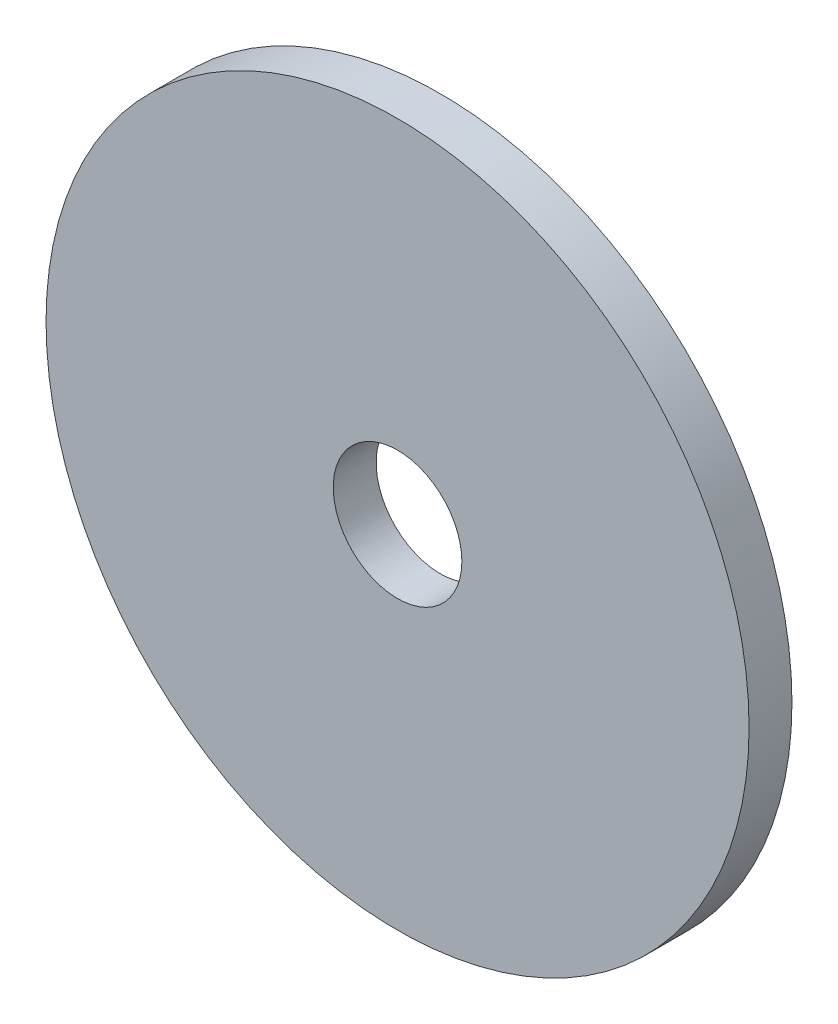
ISO-10303-21;
HEADER;
FILE_DESCRIPTION(('STEP AP214'),'2;1');
FILE_NAME('part.step','',(''),(''),'','','');
FILE_SCHEMA(('AUTOMOTIVE_DESIGN { 1 0 10303 214 1 1 1 1 }'));
ENDSEC;
DATA;
#1=APPLICATION_CONTEXT('core data for automotive mechanical design processes');
#2=APPLICATION_PROTOCOL_DEFINITION('international standard','automotive_design',2000,#1);
#3=PRODUCT_CONTEXT('',#1,'mechanical');
#4=PRODUCT('Part','Part','',(#3));
#5=PRODUCT_RELATED_PRODUCT_CATEGORY('part','',(#4));
#6=PRODUCT_DEFINITION_FORMATION('','',#4);
#7=PRODUCT_DEFINITION_CONTEXT('part definition',#1,'design');
#8=PRODUCT_DEFINITION('design','',#6,#7);
#9=PRODUCT_DEFINITION_SHAPE('','',#8);
#10=(LENGTH_UNIT() NAMED_UNIT(*) SI_UNIT(.MILLI.,.METRE.));
#11=(NAMED_UNIT(*) PLANE_ANGLE_UNIT() SI_UNIT($,.RADIAN.));
#12=(NAMED_UNIT(*) SI_UNIT($,.STERADIAN.) SOLID_ANGLE_UNIT());
#13=UNCERTAINTY_MEASURE_WITH_UNIT(LENGTH_MEASURE(1.E-05),#10,'distance_accuracy_value','');
#14=(GEOMETRIC_REPRESENTATION_CONTEXT(3) GLOBAL_UNCERTAINTY_ASSIGNED_CONTEXT((#13)) GLOBAL_UNIT_ASSIGNED_CONTEXT((#10,
#11,#12)) REPRESENTATION_CONTEXT('',''));
#15=CARTESIAN_POINT('',(0.,0.,0.));
#16=DIRECTION('',(0.,0.,1.));
#17=DIRECTION('',(1.,0.,0.));
#18=AXIS2_PLACEMENT_3D('',#15,#16,#17);
#19=CARTESIAN_POINT('',(0.,0.,2.));
#20=DIRECTION('',(0.,0.,-1.));
#21=DIRECTION('',(-1.,0.,0.));
#22=AXIS2_PLACEMENT_3D('',#19,#20,#21);
#23=CYLINDRICAL_SURFACE('',#22,16.4);
#24=CARTESIAN_POINT('',(0.,0.,2.));
#25=DIRECTION('',(0.,0.,1.));
#26=DIRECTION('',(1.,0.,0.));
#27=AXIS2_PLACEMENT_3D('',#24,#25,#26);
#28=CIRCLE('',#27,16.4);
#29=CARTESIAN_POINT('',(16.4,0.,2.));
#30=VERTEX_POINT('',#29);
#31=EDGE_CURVE('E10',#30,#30,#28,.T.);
#32=ORIENTED_EDGE('',*,*,#31,.F.);
#33=EDGE_LOOP('',(#32));
#34=FACE_BOUND('',#33,.T.);
#35=CARTESIAN_POINT('',(0.,0.,0.));
#36=DIRECTION('',(0.,0.,1.));
#37=DIRECTION('',(1.,0.,0.));
#38=AXIS2_PLACEMENT_3D('',#35,#36,#37);
#39=CIRCLE('',#38,16.4);
#40=CARTESIAN_POINT('',(16.4,0.,0.));
#41=VERTEX_POINT('',#40);
#42=EDGE_CURVE('E34',#41,#41,#39,.T.);
#43=ORIENTED_EDGE('',*,*,#42,.T.);
#44=EDGE_LOOP('',(#43));
#45=FACE_BOUND('',#44,.T.);
#46=ADVANCED_FACE('F31',(#34,#45),#23,.T.);
#47=CARTESIAN_POINT('',(0.,0.,2.));
#48=DIRECTION('',(0.,0.,1.));
#49=DIRECTION('',(1.,0.,0.));
#50=AXIS2_PLACEMENT_3D('',#47,#48,#49);
#51=PLANE('',#50);
#52=CARTESIAN_POINT('',(0.,0.,2.));
#53=DIRECTION('',(0.,0.,1.));
#54=DIRECTION('',(1.,0.,0.));
#55=AXIS2_PLACEMENT_3D('',#52,#53,#54);
#56=CIRCLE('',#55,3.);
#57=CARTESIAN_POINT('',(3.,0.,2.));
#58=VERTEX_POINT('',#57);
#59=EDGE_CURVE('E43',#58,#58,#56,.T.);
#60=ORIENTED_EDGE('',*,*,#59,.F.);
#61=EDGE_LOOP('',(#60));
#62=FACE_BOUND('',#61,.T.);
#63=ORIENTED_EDGE('',*,*,#31,.T.);
#64=EDGE_LOOP('',(#63));
#65=FACE_BOUND('',#64,.T.);
#66=ADVANCED_FACE('F58',(#62,#65),#51,.T.);
#67=CARTESIAN_POINT('',(0.,0.,0.));
#68=DIRECTION('',(0.,0.,1.));
#69=DIRECTION('',(1.,0.,0.));
#70=AXIS2_PLACEMENT_3D('',#67,#68,#69);
#71=PLANE('',#70);
#72=CARTESIAN_POINT('',(0.,0.,0.));
#73=DIRECTION('',(0.,0.,1.));
#74=DIRECTION('',(1.,0.,0.));
#75=AXIS2_PLACEMENT_3D('',#72,#73,#74);
#76=CIRCLE('',#75,3.);
#77=CARTESIAN_POINT('',(3.,0.,0.));
#78=VERTEX_POINT('',#77);
#79=EDGE_CURVE('E41',#78,#78,#76,.T.);
#80=ORIENTED_EDGE('',*,*,#79,.T.);
#81=EDGE_LOOP('',(#80));
#82=FACE_BOUND('',#81,.T.);
#83=ORIENTED_EDGE('',*,*,#42,.F.);
#84=EDGE_LOOP('',(#83));
#85=FACE_BOUND('',#84,.T.);
#86=ADVANCED_FACE('F49',(#82,#85),#71,.F.);
#87=CARTESIAN_POINT('',(0.,0.,0.));
#88=DIRECTION('',(0.,0.,1.));
#89=DIRECTION('',(1.,0.,0.));
#90=AXIS2_PLACEMENT_3D('',#87,#88,#89);
#91=CYLINDRICAL_SURFACE('',#90,3.);
#92=ORIENTED_EDGE('',*,*,#79,.F.);
#93=EDGE_LOOP('',(#92));
#94=FACE_BOUND('',#93,.T.);
#95=ORIENTED_EDGE('',*,*,#59,.T.);
#96=EDGE_LOOP('',(#95));
#97=FACE_BOUND('',#96,.T.);
#98=ADVANCED_FACE('F52',(#94,#97),#91,.F.);
#99=CLOSED_SHELL('',(#46,#66,#86,#98));
#100=MANIFOLD_SOLID_BREP('B2',#99);
#101=ADVANCED_BREP_SHAPE_REPRESENTATION('',(#18,#100),#14);
#102=SHAPE_DEFINITION_REPRESENTATION(#9,#101);
ENDSEC;
END-ISO-10303-21;
